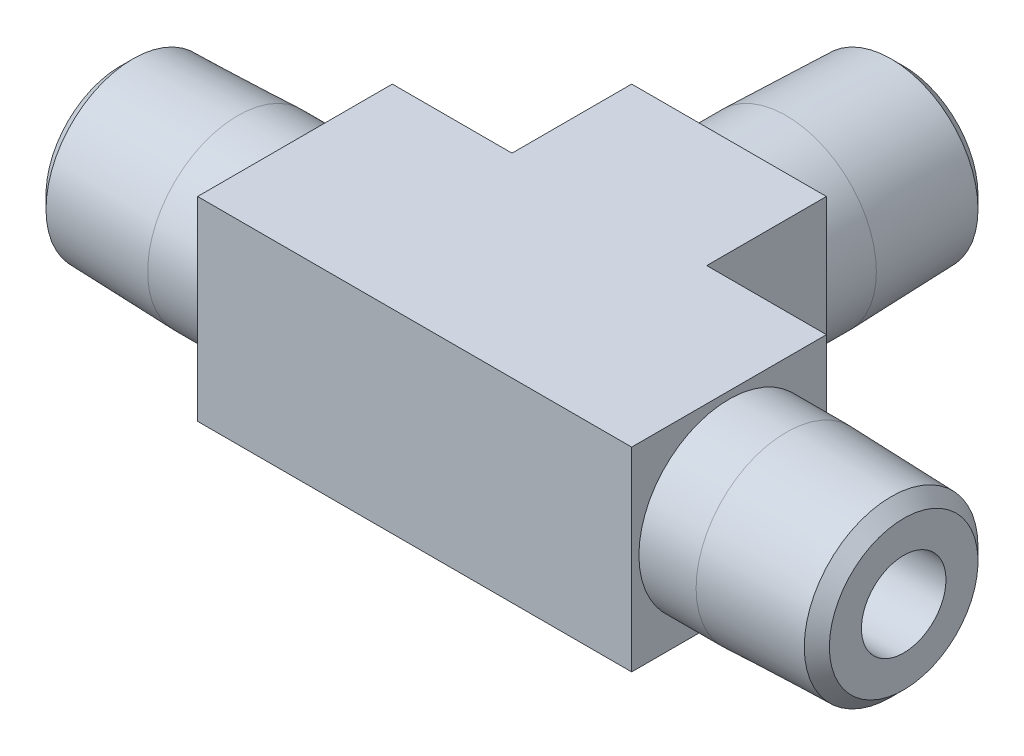
ISO-10303-21;
HEADER;
FILE_DESCRIPTION(('STEP AP214'),'2;1');
FILE_NAME('part.step','',(''),(''),'','','');
FILE_SCHEMA(('AUTOMOTIVE_DESIGN { 1 0 10303 214 1 1 1 1 }'));
ENDSEC;
DATA;
#1=APPLICATION_CONTEXT('core data for automotive mechanical design processes');
#2=APPLICATION_PROTOCOL_DEFINITION('international standard','automotive_design',2000,#1);
#3=PRODUCT_CONTEXT('',#1,'mechanical');
#4=PRODUCT('Part','Part','',(#3));
#5=PRODUCT_RELATED_PRODUCT_CATEGORY('part','',(#4));
#6=PRODUCT_DEFINITION_FORMATION('','',#4);
#7=PRODUCT_DEFINITION_CONTEXT('part definition',#1,'design');
#8=PRODUCT_DEFINITION('design','',#6,#7);
#9=PRODUCT_DEFINITION_SHAPE('','',#8);
#10=(LENGTH_UNIT() NAMED_UNIT(*) SI_UNIT(.MILLI.,.METRE.));
#11=(NAMED_UNIT(*) PLANE_ANGLE_UNIT() SI_UNIT($,.RADIAN.));
#12=(NAMED_UNIT(*) SI_UNIT($,.STERADIAN.) SOLID_ANGLE_UNIT());
#13=UNCERTAINTY_MEASURE_WITH_UNIT(LENGTH_MEASURE(1.E-05),#10,'distance_accuracy_value','');
#14=(GEOMETRIC_REPRESENTATION_CONTEXT(3) GLOBAL_UNCERTAINTY_ASSIGNED_CONTEXT((#13)) GLOBAL_UNIT_ASSIGNED_CONTEXT((#10,
#11,#12)) REPRESENTATION_CONTEXT('',''));
#15=CARTESIAN_POINT('',(0.,0.,0.));
#16=DIRECTION('',(0.,0.,1.));
#17=DIRECTION('',(1.,0.,0.));
#18=AXIS2_PLACEMENT_3D('',#15,#16,#17);
#19=CARTESIAN_POINT('',(22.352,0.,-17.36852));
#20=DIRECTION('',(0.,0.,-1.));
#21=DIRECTION('',(-1.,0.,0.));
#22=AXIS2_PLACEMENT_3D('',#19,#20,#21);
#23=CYLINDRICAL_SURFACE('',#22,2.413);
#24=CARTESIAN_POINT('',(22.352,0.,-22.352));
#25=DIRECTION('',(0.,0.,-1.));
#26=DIRECTION('',(-1.,0.,0.));
#27=AXIS2_PLACEMENT_3D('',#24,#25,#26);
#28=CIRCLE('',#27,2.413);
#29=CARTESIAN_POINT('',(19.939,0.,-22.352));
#30=VERTEX_POINT('',#29);
#31=EDGE_CURVE('E89',#30,#30,#28,.F.);
#32=ORIENTED_EDGE('',*,*,#31,.F.);
#33=EDGE_LOOP('',(#32));
#34=FACE_BOUND('',#33,.T.);
#35=CARTESIAN_POINT('',(22.352,0.,0.));
#36=DIRECTION('',(0.707106781186548,0.,-0.707106781186547));
#37=DIRECTION('',(-0.707106781186547,0.,-0.707106781186548));
#38=AXIS2_PLACEMENT_3D('',#35,#36,#37);
#39=ELLIPSE('',#38,3.41249732600628,2.413);
#40=CARTESIAN_POINT('',(22.352,2.413,0.));
#41=VERTEX_POINT('',#40);
#42=CARTESIAN_POINT('',(22.352,-2.413,0.));
#43=VERTEX_POINT('',#42);
#44=EDGE_CURVE('E88',#41,#43,#39,.F.);
#45=ORIENTED_EDGE('',*,*,#44,.T.);
#46=CARTESIAN_POINT('',(22.352,0.,0.));
#47=DIRECTION('',(-0.707106781186547,0.,-0.707106781186548));
#48=DIRECTION('',(0.707106781186548,0.,-0.707106781186547));
#49=AXIS2_PLACEMENT_3D('',#46,#47,#48);
#50=ELLIPSE('',#49,3.41249732600628,2.413);
#51=EDGE_CURVE('E20',#43,#41,#50,.F.);
#52=ORIENTED_EDGE('',*,*,#51,.T.);
#53=EDGE_LOOP('',(#45,#52));
#54=FACE_BOUND('',#53,.T.);
#55=ADVANCED_FACE('F17',(#34,#54),#23,.F.);
#56=CARTESIAN_POINT('',(39.72052,0.,0.));
#57=DIRECTION('',(1.,0.,0.));
#58=DIRECTION('',(0.,0.,-1.));
#59=AXIS2_PLACEMENT_3D('',#56,#57,#58);
#60=CYLINDRICAL_SURFACE('',#59,2.413);
#61=CARTESIAN_POINT('',(0.,0.,0.));
#62=DIRECTION('',(1.,0.,0.));
#63=DIRECTION('',(0.,0.,-1.));
#64=AXIS2_PLACEMENT_3D('',#61,#62,#63);
#65=CIRCLE('',#64,2.413);
#66=CARTESIAN_POINT('',(0.,0.,-2.413));
#67=VERTEX_POINT('',#66);
#68=EDGE_CURVE('E96',#67,#67,#65,.T.);
#69=ORIENTED_EDGE('',*,*,#68,.F.);
#70=EDGE_LOOP('',(#69));
#71=FACE_BOUND('',#70,.T.);
#72=CARTESIAN_POINT('',(44.704,0.,0.));
#73=DIRECTION('',(1.,0.,0.));
#74=DIRECTION('',(0.,0.,-1.));
#75=AXIS2_PLACEMENT_3D('',#72,#73,#74);
#76=CIRCLE('',#75,2.413);
#77=CARTESIAN_POINT('',(44.704,0.,-2.413));
#78=VERTEX_POINT('',#77);
#79=EDGE_CURVE('E91',#78,#78,#76,.F.);
#80=ORIENTED_EDGE('',*,*,#79,.F.);
#81=EDGE_LOOP('',(#80));
#82=FACE_BOUND('',#81,.T.);
#83=ORIENTED_EDGE('',*,*,#51,.F.);
#84=ORIENTED_EDGE('',*,*,#44,.F.);
#85=EDGE_LOOP('',(#83,#84));
#86=FACE_BOUND('',#85,.T.);
#87=ADVANCED_FACE('F87',(#71,#82,#86),#60,.F.);
#88=CARTESIAN_POINT('',(19.8846001989067,0.,-22.352));
#89=DIRECTION('',(0.,0.,-1.));
#90=DIRECTION('',(-1.,0.,0.));
#91=AXIS2_PLACEMENT_3D('',#88,#89,#90);
#92=PLANE('',#91);
#93=CARTESIAN_POINT('',(22.352,0.,-22.3520000000121));
#94=DIRECTION('',(0.,0.,1.));
#95=DIRECTION('',(1.,0.,0.));
#96=AXIS2_PLACEMENT_3D('',#93,#94,#95);
#97=CIRCLE('',#96,4.24052999999198);
#98=CARTESIAN_POINT('',(26.592529999992,0.,-22.3520000000121));
#99=VERTEX_POINT('',#98);
#100=EDGE_CURVE('E99',#99,#99,#97,.T.);
#101=ORIENTED_EDGE('',*,*,#100,.F.);
#102=EDGE_LOOP('',(#101));
#103=FACE_BOUND('',#102,.T.);
#104=ORIENTED_EDGE('',*,*,#31,.T.);
#105=EDGE_LOOP('',(#104));
#106=FACE_BOUND('',#105,.T.);
#107=ADVANCED_FACE('F281',(#103,#106),#92,.T.);
#108=CARTESIAN_POINT('',(44.704,0.,-2.46739980109326));
#109=DIRECTION('',(1.,0.,0.));
#110=DIRECTION('',(0.,0.,-1.));
#111=AXIS2_PLACEMENT_3D('',#108,#109,#110);
#112=PLANE('',#111);
#113=CARTESIAN_POINT('',(44.7040000000243,0.,0.));
#114=DIRECTION('',(-1.,0.,0.));
#115=DIRECTION('',(0.,0.,1.));
#116=AXIS2_PLACEMENT_3D('',#113,#114,#115);
#117=CIRCLE('',#116,4.24052999994728);
#118=CARTESIAN_POINT('',(44.7040000000243,0.,4.24052999994728));
#119=VERTEX_POINT('',#118);
#120=EDGE_CURVE('E102',#119,#119,#117,.T.);
#121=ORIENTED_EDGE('',*,*,#120,.F.);
#122=EDGE_LOOP('',(#121));
#123=FACE_BOUND('',#122,.T.);
#124=ORIENTED_EDGE('',*,*,#79,.T.);
#125=EDGE_LOOP('',(#124));
#126=FACE_BOUND('',#125,.T.);
#127=ADVANCED_FACE('F275',(#123,#126),#112,.T.);
#128=CARTESIAN_POINT('',(0.,0.,2.46739980109326));
#129=DIRECTION('',(-1.,0.,0.));
#130=DIRECTION('',(0.,0.,1.));
#131=AXIS2_PLACEMENT_3D('',#128,#129,#130);
#132=PLANE('',#131);
#133=CARTESIAN_POINT('',(-5.68432020203735E-11,0.,0.));
#134=DIRECTION('',(1.,0.,0.));
#135=DIRECTION('',(0.,0.,-1.));
#136=AXIS2_PLACEMENT_3D('',#133,#134,#135);
#137=CIRCLE('',#136,4.24053000000413);
#138=CARTESIAN_POINT('',(-5.68425527884566E-11,0.,-4.24053000000413));
#139=VERTEX_POINT('',#138);
#140=EDGE_CURVE('E105',#139,#139,#137,.T.);
#141=ORIENTED_EDGE('',*,*,#140,.F.);
#142=EDGE_LOOP('',(#141));
#143=FACE_BOUND('',#142,.T.);
#144=ORIENTED_EDGE('',*,*,#68,.T.);
#145=EDGE_LOOP('',(#144));
#146=FACE_BOUND('',#145,.T.);
#147=ADVANCED_FACE('F271',(#143,#146),#132,.T.);
#148=CARTESIAN_POINT('',(22.352,0.,-21.6354196002726));
#149=DIRECTION('',(0.,0.,1.));
#150=DIRECTION('',(1.,0.,0.));
#151=AXIS2_PLACEMENT_3D('',#148,#149,#150);
#152=CONICAL_SURFACE('',#151,4.95711039973153,0.785398163397448);
#153=CARTESIAN_POINT('',(22.352,0.,-21.6354196002726));
#154=DIRECTION('',(0.,0.,1.));
#155=DIRECTION('',(-1.,0.,0.));
#156=AXIS2_PLACEMENT_3D('',#153,#154,#155);
#157=CIRCLE('',#156,4.95711039971377);
#158=CARTESIAN_POINT('',(17.3948896002862,0.,-21.6354196002726));
#159=VERTEX_POINT('',#158);
#160=EDGE_CURVE('E108',#159,#159,#157,.T.);
#161=ORIENTED_EDGE('',*,*,#160,.F.);
#162=EDGE_LOOP('',(#161));
#163=FACE_BOUND('',#162,.T.);
#164=ORIENTED_EDGE('',*,*,#100,.T.);
#165=EDGE_LOOP('',(#164));
#166=FACE_BOUND('',#165,.T.);
#167=ADVANCED_FACE('F274',(#163,#166),#152,.T.);
#168=CARTESIAN_POINT('',(43.9874196002847,0.,0.));
#169=DIRECTION('',(-1.,0.,0.));
#170=DIRECTION('',(0.,0.,1.));
#171=AXIS2_PLACEMENT_3D('',#168,#169,#170);
#172=CONICAL_SURFACE('',#171,4.95711039968683,0.785398163397448);
#173=CARTESIAN_POINT('',(43.9874196002847,0.,0.));
#174=DIRECTION('',(-1.,0.,0.));
#175=DIRECTION('',(0.,0.,-1.));
#176=AXIS2_PLACEMENT_3D('',#173,#174,#175);
#177=CIRCLE('',#176,4.95711039971347);
#178=CARTESIAN_POINT('',(43.9874196002847,0.,-4.95711039971347));
#179=VERTEX_POINT('',#178);
#180=EDGE_CURVE('E126',#179,#179,#177,.T.);
#181=ORIENTED_EDGE('',*,*,#180,.F.);
#182=EDGE_LOOP('',(#181));
#183=FACE_BOUND('',#182,.T.);
#184=ORIENTED_EDGE('',*,*,#120,.T.);
#185=EDGE_LOOP('',(#184));
#186=FACE_BOUND('',#185,.T.);
#187=ADVANCED_FACE('F267',(#183,#186),#172,.T.);
#188=CARTESIAN_POINT('',(0.716580399682699,0.,0.));
#189=DIRECTION('',(1.,0.,0.));
#190=DIRECTION('',(0.,0.,-1.));
#191=AXIS2_PLACEMENT_3D('',#188,#189,#190);
#192=CONICAL_SURFACE('',#191,4.95711039968683,0.785398163357785);
#193=CARTESIAN_POINT('',(0.716580399739541,0.,0.));
#194=DIRECTION('',(1.,0.,0.));
#195=DIRECTION('',(0.,0.,1.));
#196=AXIS2_PLACEMENT_3D('',#193,#194,#195);
#197=CIRCLE('',#196,4.95711039971703);
#198=CARTESIAN_POINT('',(0.716580399739541,0.,4.95711039971702));
#199=VERTEX_POINT('',#198);
#200=EDGE_CURVE('E129',#199,#199,#197,.T.);
#201=ORIENTED_EDGE('',*,*,#200,.F.);
#202=EDGE_LOOP('',(#201));
#203=FACE_BOUND('',#202,.T.);
#204=ORIENTED_EDGE('',*,*,#140,.T.);
#205=EDGE_LOOP('',(#204));
#206=FACE_BOUND('',#205,.T.);
#207=ADVANCED_FACE('F263',(#203,#206),#192,.T.);
#208=CARTESIAN_POINT('',(22.352,0.,-15.6489400000055));
#209=DIRECTION('',(0.,0.,1.));
#210=DIRECTION('',(1.,0.,0.));
#211=AXIS2_PLACEMENT_3D('',#208,#209,#210);
#212=CONICAL_SURFACE('',#211,5.14349999999759,0.031125038321427);
#213=CARTESIAN_POINT('',(22.352,0.,-15.64894));
#214=DIRECTION('',(0.,0.,1.));
#215=DIRECTION('',(1.,0.,0.));
#216=AXIS2_PLACEMENT_3D('',#213,#214,#215);
#217=CIRCLE('',#216,5.1435);
#218=CARTESIAN_POINT('',(27.4955,0.,-15.64894));
#219=VERTEX_POINT('',#218);
#220=EDGE_CURVE('E132',#219,#219,#217,.T.);
#221=ORIENTED_EDGE('',*,*,#220,.F.);
#222=EDGE_LOOP('',(#221));
#223=FACE_BOUND('',#222,.T.);
#224=ORIENTED_EDGE('',*,*,#160,.T.);
#225=EDGE_LOOP('',(#224));
#226=FACE_BOUND('',#225,.T.);
#227=ADVANCED_FACE('F266',(#223,#226),#212,.T.);
#228=CARTESIAN_POINT('',(38.0009400000176,0.,0.));
#229=DIRECTION('',(-1.,0.,0.));
#230=DIRECTION('',(0.,0.,1.));
#231=AXIS2_PLACEMENT_3D('',#228,#229,#230);
#232=CONICAL_SURFACE('',#231,5.14349999999908,0.0311250383217229);
#233=CARTESIAN_POINT('',(38.00094,0.,0.));
#234=DIRECTION('',(-1.,0.,0.));
#235=DIRECTION('',(0.,0.,1.));
#236=AXIS2_PLACEMENT_3D('',#233,#234,#235);
#237=CIRCLE('',#236,5.1435);
#238=CARTESIAN_POINT('',(38.00094,0.,5.1435));
#239=VERTEX_POINT('',#238);
#240=EDGE_CURVE('E135',#239,#239,#237,.T.);
#241=ORIENTED_EDGE('',*,*,#240,.F.);
#242=EDGE_LOOP('',(#241));
#243=FACE_BOUND('',#242,.T.);
#244=ORIENTED_EDGE('',*,*,#180,.T.);
#245=EDGE_LOOP('',(#244));
#246=FACE_BOUND('',#245,.T.);
#247=ADVANCED_FACE('F259',(#243,#246),#232,.T.);
#248=CARTESIAN_POINT('',(6.70306000006349,0.,0.));
#249=DIRECTION('',(1.,0.,0.));
#250=DIRECTION('',(0.,0.,-1.));
#251=AXIS2_PLACEMENT_3D('',#248,#249,#250);
#252=CONICAL_SURFACE('',#251,5.14350000000263,0.0311250383214272);
#253=CARTESIAN_POINT('',(6.70306,0.,0.));
#254=DIRECTION('',(1.,0.,0.));
#255=DIRECTION('',(0.,0.,-1.));
#256=AXIS2_PLACEMENT_3D('',#253,#254,#255);
#257=CIRCLE('',#256,5.1435);
#258=CARTESIAN_POINT('',(6.70306,0.,-5.1435));
#259=VERTEX_POINT('',#258);
#260=EDGE_CURVE('E138',#259,#259,#257,.T.);
#261=ORIENTED_EDGE('',*,*,#260,.F.);
#262=EDGE_LOOP('',(#261));
#263=FACE_BOUND('',#262,.T.);
#264=ORIENTED_EDGE('',*,*,#200,.T.);
#265=EDGE_LOOP('',(#264));
#266=FACE_BOUND('',#265,.T.);
#267=ADVANCED_FACE('F255',(#263,#266),#252,.T.);
#268=CARTESIAN_POINT('',(22.352,0.,-14.01699));
#269=DIRECTION('',(0.,0.,1.));
#270=DIRECTION('',(1.,0.,0.));
#271=AXIS2_PLACEMENT_3D('',#268,#269,#270);
#272=CYLINDRICAL_SURFACE('',#271,5.1435);
#273=CARTESIAN_POINT('',(22.352,0.,-12.38504));
#274=DIRECTION('',(0.,0.,1.));
#275=DIRECTION('',(1.,0.,0.));
#276=AXIS2_PLACEMENT_3D('',#273,#274,#275);
#277=CIRCLE('',#276,5.1435);
#278=CARTESIAN_POINT('',(27.4955,0.,-12.38504));
#279=VERTEX_POINT('',#278);
#280=EDGE_CURVE('E109',#279,#279,#277,.T.);
#281=ORIENTED_EDGE('',*,*,#280,.F.);
#282=EDGE_LOOP('',(#281));
#283=FACE_BOUND('',#282,.T.);
#284=ORIENTED_EDGE('',*,*,#220,.T.);
#285=EDGE_LOOP('',(#284));
#286=FACE_BOUND('',#285,.T.);
#287=ADVANCED_FACE('F258',(#283,#286),#272,.T.);
#288=CARTESIAN_POINT('',(36.36899,0.,0.));
#289=DIRECTION('',(-1.,0.,0.));
#290=DIRECTION('',(0.,0.,1.));
#291=AXIS2_PLACEMENT_3D('',#288,#289,#290);
#292=CYLINDRICAL_SURFACE('',#291,5.1435);
#293=CARTESIAN_POINT('',(34.73704,0.,0.));
#294=DIRECTION('',(-1.,0.,0.));
#295=DIRECTION('',(0.,0.,1.));
#296=AXIS2_PLACEMENT_3D('',#293,#294,#295);
#297=CIRCLE('',#296,5.1435);
#298=CARTESIAN_POINT('',(34.73704,0.,5.1435));
#299=VERTEX_POINT('',#298);
#300=EDGE_CURVE('E114',#299,#299,#297,.T.);
#301=ORIENTED_EDGE('',*,*,#300,.F.);
#302=EDGE_LOOP('',(#301));
#303=FACE_BOUND('',#302,.T.);
#304=ORIENTED_EDGE('',*,*,#240,.T.);
#305=EDGE_LOOP('',(#304));
#306=FACE_BOUND('',#305,.T.);
#307=ADVANCED_FACE('F251',(#303,#306),#292,.T.);
#308=CARTESIAN_POINT('',(8.33501,0.,0.));
#309=DIRECTION('',(1.,0.,0.));
#310=DIRECTION('',(0.,0.,-1.));
#311=AXIS2_PLACEMENT_3D('',#308,#309,#310);
#312=CYLINDRICAL_SURFACE('',#311,5.1435);
#313=CARTESIAN_POINT('',(9.96696,0.,0.));
#314=DIRECTION('',(1.,0.,0.));
#315=DIRECTION('',(0.,0.,-1.));
#316=AXIS2_PLACEMENT_3D('',#313,#314,#315);
#317=CIRCLE('',#316,5.1435);
#318=CARTESIAN_POINT('',(9.96696,0.,-5.1435));
#319=VERTEX_POINT('',#318);
#320=EDGE_CURVE('E119',#319,#319,#317,.T.);
#321=ORIENTED_EDGE('',*,*,#320,.F.);
#322=EDGE_LOOP('',(#321));
#323=FACE_BOUND('',#322,.T.);
#324=ORIENTED_EDGE('',*,*,#260,.T.);
#325=EDGE_LOOP('',(#324));
#326=FACE_BOUND('',#325,.T.);
#327=ADVANCED_FACE('F248',(#323,#326),#312,.T.);
#328=CARTESIAN_POINT('',(9.96696,5.55625,5.55625));
#329=DIRECTION('',(0.,1.,0.));
#330=DIRECTION('',(-1.,0.,0.));
#331=AXIS2_PLACEMENT_3D('',#328,#329,#330);
#332=PLANE('',#331);
#333=DIRECTION('',(-1.,0.,0.));
#334=VECTOR('',#333,1.);
#335=CARTESIAN_POINT('',(25.130125,5.55625,-12.38504));
#336=LINE('',#335,#334);
#337=CARTESIAN_POINT('',(16.79575,5.55625,-12.38504));
#338=VERTEX_POINT('',#337);
#339=CARTESIAN_POINT('',(27.90825,5.55625,-12.38504));
#340=VERTEX_POINT('',#339);
#341=EDGE_CURVE('E113',#338,#340,#336,.F.);
#342=ORIENTED_EDGE('',*,*,#341,.F.);
#343=DIRECTION('',(0.,0.,1.));
#344=VECTOR('',#343,1.);
#345=CARTESIAN_POINT('',(16.79575,5.55625,0.));
#346=LINE('',#345,#344);
#347=CARTESIAN_POINT('',(16.79575,5.55625,-5.55625));
#348=VERTEX_POINT('',#347);
#349=EDGE_CURVE('E141',#348,#338,#346,.F.);
#350=ORIENTED_EDGE('',*,*,#349,.F.);
#351=DIRECTION('',(-1.,0.,0.));
#352=VECTOR('',#351,1.);
#353=CARTESIAN_POINT('',(9.96696,5.55625,-5.55625));
#354=LINE('',#353,#352);
#355=CARTESIAN_POINT('',(9.96696,5.55625,-5.55625));
#356=VERTEX_POINT('',#355);
#357=EDGE_CURVE('E172',#356,#348,#354,.F.);
#358=ORIENTED_EDGE('',*,*,#357,.F.);
#359=DIRECTION('',(0.,0.,1.));
#360=VECTOR('',#359,1.);
#361=CARTESIAN_POINT('',(9.96696,5.55625,-2.778125));
#362=LINE('',#361,#360);
#363=CARTESIAN_POINT('',(9.96696,5.55625,5.55625));
#364=VERTEX_POINT('',#363);
#365=EDGE_CURVE('E123',#364,#356,#362,.F.);
#366=ORIENTED_EDGE('',*,*,#365,.F.);
#367=DIRECTION('',(1.,0.,0.));
#368=VECTOR('',#367,1.);
#369=CARTESIAN_POINT('',(9.96696,5.55625,5.55625));
#370=LINE('',#369,#368);
#371=CARTESIAN_POINT('',(34.73704,5.55625,5.55625));
#372=VERTEX_POINT('',#371);
#373=EDGE_CURVE('E163',#372,#364,#370,.F.);
#374=ORIENTED_EDGE('',*,*,#373,.F.);
#375=DIRECTION('',(0.,0.,-1.));
#376=VECTOR('',#375,1.);
#377=CARTESIAN_POINT('',(34.73704,5.55625,-2.778125));
#378=LINE('',#377,#376);
#379=CARTESIAN_POINT('',(34.73704,5.55625,-5.55625));
#380=VERTEX_POINT('',#379);
#381=EDGE_CURVE('E157',#380,#372,#378,.F.);
#382=ORIENTED_EDGE('',*,*,#381,.F.);
#383=DIRECTION('',(-1.,0.,0.));
#384=VECTOR('',#383,1.);
#385=CARTESIAN_POINT('',(9.96696,5.55625,-5.55625));
#386=LINE('',#385,#384);
#387=CARTESIAN_POINT('',(27.90825,5.55625,-5.55625));
#388=VERTEX_POINT('',#387);
#389=EDGE_CURVE('E154',#388,#380,#386,.F.);
#390=ORIENTED_EDGE('',*,*,#389,.F.);
#391=DIRECTION('',(0.,0.,1.));
#392=VECTOR('',#391,1.);
#393=CARTESIAN_POINT('',(27.90825,5.55625,0.));
#394=LINE('',#393,#392);
#395=EDGE_CURVE('E149',#340,#388,#394,.T.);
#396=ORIENTED_EDGE('',*,*,#395,.F.);
#397=EDGE_LOOP('',(#342,#350,#358,#366,#374,#382,#390,#396));
#398=FACE_BOUND('',#397,.T.);
#399=ADVANCED_FACE('F205',(#398),#332,.T.);
#400=CARTESIAN_POINT('',(16.79575,5.55625,0.));
#401=DIRECTION('',(-1.,0.,0.));
#402=DIRECTION('',(0.,-1.,0.));
#403=AXIS2_PLACEMENT_3D('',#400,#401,#402);
#404=PLANE('',#403);
#405=DIRECTION('',(0.,1.,0.));
#406=VECTOR('',#405,1.);
#407=CARTESIAN_POINT('',(16.79575,5.55625,-5.55625));
#408=LINE('',#407,#406);
#409=CARTESIAN_POINT('',(16.79575,-5.55625,-5.55625));
#410=VERTEX_POINT('',#409);
#411=EDGE_CURVE('E122',#348,#410,#408,.F.);
#412=ORIENTED_EDGE('',*,*,#411,.F.);
#413=ORIENTED_EDGE('',*,*,#349,.T.);
#414=DIRECTION('',(0.,1.,0.));
#415=VECTOR('',#414,1.);
#416=CARTESIAN_POINT('',(16.79575,0.,-12.38504));
#417=LINE('',#416,#415);
#418=CARTESIAN_POINT('',(16.79575,-5.55625,-12.38504));
#419=VERTEX_POINT('',#418);
#420=EDGE_CURVE('E143',#419,#338,#417,.T.);
#421=ORIENTED_EDGE('',*,*,#420,.F.);
#422=DIRECTION('',(0.,0.,1.));
#423=VECTOR('',#422,1.);
#424=CARTESIAN_POINT('',(16.79575,-5.55625,-5.55625));
#425=LINE('',#424,#423);
#426=EDGE_CURVE('E175',#410,#419,#425,.F.);
#427=ORIENTED_EDGE('',*,*,#426,.F.);
#428=EDGE_LOOP('',(#412,#413,#421,#427));
#429=FACE_BOUND('',#428,.T.);
#430=ADVANCED_FACE('F210',(#429),#404,.T.);
#431=CARTESIAN_POINT('',(25.130125,0.,-12.38504));
#432=DIRECTION('',(0.,0.,-1.));
#433=DIRECTION('',(-1.,0.,0.));
#434=AXIS2_PLACEMENT_3D('',#431,#432,#433);
#435=PLANE('',#434);
#436=ORIENTED_EDGE('',*,*,#280,.T.);
#437=EDGE_LOOP('',(#436));
#438=FACE_BOUND('',#437,.T.);
#439=ORIENTED_EDGE('',*,*,#341,.T.);
#440=DIRECTION('',(0.,1.,0.));
#441=VECTOR('',#440,1.);
#442=CARTESIAN_POINT('',(27.90825,-5.55625,-12.38504));
#443=LINE('',#442,#441);
#444=CARTESIAN_POINT('',(27.90825,-5.55625,-12.38504));
#445=VERTEX_POINT('',#444);
#446=EDGE_CURVE('E112',#445,#340,#443,.T.);
#447=ORIENTED_EDGE('',*,*,#446,.F.);
#448=DIRECTION('',(1.,0.,0.));
#449=VECTOR('',#448,1.);
#450=CARTESIAN_POINT('',(9.96696,-5.55625,-12.38504));
#451=LINE('',#450,#449);
#452=EDGE_CURVE('E178',#419,#445,#451,.T.);
#453=ORIENTED_EDGE('',*,*,#452,.F.);
#454=ORIENTED_EDGE('',*,*,#420,.T.);
#455=EDGE_LOOP('',(#439,#447,#453,#454));
#456=FACE_BOUND('',#455,.T.);
#457=ADVANCED_FACE('F214',(#438,#456),#435,.T.);
#458=CARTESIAN_POINT('',(27.90825,-5.55625,0.));
#459=DIRECTION('',(1.,0.,0.));
#460=DIRECTION('',(0.,1.,0.));
#461=AXIS2_PLACEMENT_3D('',#458,#459,#460);
#462=PLANE('',#461);
#463=ORIENTED_EDGE('',*,*,#446,.T.);
#464=ORIENTED_EDGE('',*,*,#395,.T.);
#465=DIRECTION('',(0.,1.,0.));
#466=VECTOR('',#465,1.);
#467=CARTESIAN_POINT('',(27.90825,5.55625,-5.55625));
#468=LINE('',#467,#466);
#469=CARTESIAN_POINT('',(27.90825,-5.55625,-5.55625));
#470=VERTEX_POINT('',#469);
#471=EDGE_CURVE('E151',#470,#388,#468,.T.);
#472=ORIENTED_EDGE('',*,*,#471,.F.);
#473=DIRECTION('',(0.,0.,1.));
#474=VECTOR('',#473,1.);
#475=CARTESIAN_POINT('',(27.90825,-5.55625,-5.55625));
#476=LINE('',#475,#474);
#477=EDGE_CURVE('E181',#445,#470,#476,.T.);
#478=ORIENTED_EDGE('',*,*,#477,.F.);
#479=EDGE_LOOP('',(#463,#464,#472,#478));
#480=FACE_BOUND('',#479,.T.);
#481=ADVANCED_FACE('F217',(#480),#462,.T.);
#482=CARTESIAN_POINT('',(9.96696,5.55625,-5.55625));
#483=DIRECTION('',(0.,0.,-1.));
#484=DIRECTION('',(-1.,0.,0.));
#485=AXIS2_PLACEMENT_3D('',#482,#483,#484);
#486=PLANE('',#485);
#487=DIRECTION('',(0.,1.,0.));
#488=VECTOR('',#487,1.);
#489=CARTESIAN_POINT('',(34.73704,0.,-5.55625));
#490=LINE('',#489,#488);
#491=CARTESIAN_POINT('',(34.73704,-5.55625,-5.55625));
#492=VERTEX_POINT('',#491);
#493=EDGE_CURVE('E118',#492,#380,#490,.T.);
#494=ORIENTED_EDGE('',*,*,#493,.F.);
#495=DIRECTION('',(1.,0.,0.));
#496=VECTOR('',#495,1.);
#497=CARTESIAN_POINT('',(9.96696,-5.55625,-5.55625));
#498=LINE('',#497,#496);
#499=EDGE_CURVE('E184',#470,#492,#498,.T.);
#500=ORIENTED_EDGE('',*,*,#499,.F.);
#501=ORIENTED_EDGE('',*,*,#471,.T.);
#502=ORIENTED_EDGE('',*,*,#389,.T.);
#503=EDGE_LOOP('',(#494,#500,#501,#502));
#504=FACE_BOUND('',#503,.T.);
#505=ADVANCED_FACE('F221',(#504),#486,.T.);
#506=CARTESIAN_POINT('',(34.73704,0.,-2.778125));
#507=DIRECTION('',(1.,0.,0.));
#508=DIRECTION('',(0.,0.,-1.));
#509=AXIS2_PLACEMENT_3D('',#506,#507,#508);
#510=PLANE('',#509);
#511=ORIENTED_EDGE('',*,*,#300,.T.);
#512=EDGE_LOOP('',(#511));
#513=FACE_BOUND('',#512,.T.);
#514=DIRECTION('',(0.,0.,1.));
#515=VECTOR('',#514,1.);
#516=CARTESIAN_POINT('',(34.73704,-5.55625,-5.55625));
#517=LINE('',#516,#515);
#518=CARTESIAN_POINT('',(34.73704,-5.55625,5.55625));
#519=VERTEX_POINT('',#518);
#520=EDGE_CURVE('E187',#492,#519,#517,.T.);
#521=ORIENTED_EDGE('',*,*,#520,.F.);
#522=ORIENTED_EDGE('',*,*,#493,.T.);
#523=ORIENTED_EDGE('',*,*,#381,.T.);
#524=DIRECTION('',(0.,1.,0.));
#525=VECTOR('',#524,1.);
#526=CARTESIAN_POINT('',(34.73704,-5.55625,5.55625));
#527=LINE('',#526,#525);
#528=EDGE_CURVE('E117',#519,#372,#527,.T.);
#529=ORIENTED_EDGE('',*,*,#528,.F.);
#530=EDGE_LOOP('',(#521,#522,#523,#529));
#531=FACE_BOUND('',#530,.T.);
#532=ADVANCED_FACE('F224',(#513,#531),#510,.T.);
#533=CARTESIAN_POINT('',(9.96696,-5.55625,5.55625));
#534=DIRECTION('',(0.,0.,1.));
#535=DIRECTION('',(1.,0.,0.));
#536=AXIS2_PLACEMENT_3D('',#533,#534,#535);
#537=PLANE('',#536);
#538=ORIENTED_EDGE('',*,*,#528,.T.);
#539=ORIENTED_EDGE('',*,*,#373,.T.);
#540=DIRECTION('',(0.,1.,0.));
#541=VECTOR('',#540,1.);
#542=CARTESIAN_POINT('',(9.96696,0.,5.55625));
#543=LINE('',#542,#541);
#544=CARTESIAN_POINT('',(9.96696,-5.55625,5.55625));
#545=VERTEX_POINT('',#544);
#546=EDGE_CURVE('E165',#545,#364,#543,.T.);
#547=ORIENTED_EDGE('',*,*,#546,.F.);
#548=DIRECTION('',(1.,0.,0.));
#549=VECTOR('',#548,1.);
#550=CARTESIAN_POINT('',(9.96696,-5.55625,5.55625));
#551=LINE('',#550,#549);
#552=EDGE_CURVE('E190',#519,#545,#551,.F.);
#553=ORIENTED_EDGE('',*,*,#552,.F.);
#554=EDGE_LOOP('',(#538,#539,#547,#553));
#555=FACE_BOUND('',#554,.T.);
#556=ADVANCED_FACE('F201',(#555),#537,.T.);
#557=CARTESIAN_POINT('',(9.96696,0.,-2.778125));
#558=DIRECTION('',(-1.,0.,0.));
#559=DIRECTION('',(0.,0.,1.));
#560=AXIS2_PLACEMENT_3D('',#557,#558,#559);
#561=PLANE('',#560);
#562=ORIENTED_EDGE('',*,*,#320,.T.);
#563=EDGE_LOOP('',(#562));
#564=FACE_BOUND('',#563,.T.);
#565=ORIENTED_EDGE('',*,*,#365,.T.);
#566=DIRECTION('',(0.,1.,0.));
#567=VECTOR('',#566,1.);
#568=CARTESIAN_POINT('',(9.96696,5.55625,-5.55625));
#569=LINE('',#568,#567);
#570=CARTESIAN_POINT('',(9.96696,-5.55625,-5.55625));
#571=VERTEX_POINT('',#570);
#572=EDGE_CURVE('E35',#571,#356,#569,.T.);
#573=ORIENTED_EDGE('',*,*,#572,.F.);
#574=DIRECTION('',(0.,0.,1.));
#575=VECTOR('',#574,1.);
#576=CARTESIAN_POINT('',(9.96696,-5.55625,-5.55625));
#577=LINE('',#576,#575);
#578=EDGE_CURVE('E26',#545,#571,#577,.F.);
#579=ORIENTED_EDGE('',*,*,#578,.F.);
#580=ORIENTED_EDGE('',*,*,#546,.T.);
#581=EDGE_LOOP('',(#565,#573,#579,#580));
#582=FACE_BOUND('',#581,.T.);
#583=ADVANCED_FACE('F197',(#564,#582),#561,.T.);
#584=CARTESIAN_POINT('',(9.96696,5.55625,-5.55625));
#585=DIRECTION('',(0.,0.,-1.));
#586=DIRECTION('',(-1.,0.,0.));
#587=AXIS2_PLACEMENT_3D('',#584,#585,#586);
#588=PLANE('',#587);
#589=ORIENTED_EDGE('',*,*,#572,.T.);
#590=ORIENTED_EDGE('',*,*,#357,.T.);
#591=ORIENTED_EDGE('',*,*,#411,.T.);
#592=DIRECTION('',(1.,0.,0.));
#593=VECTOR('',#592,1.);
#594=CARTESIAN_POINT('',(9.96696,-5.55625,-5.55625));
#595=LINE('',#594,#593);
#596=EDGE_CURVE('E10',#571,#410,#595,.T.);
#597=ORIENTED_EDGE('',*,*,#596,.F.);
#598=EDGE_LOOP('',(#589,#590,#591,#597));
#599=FACE_BOUND('',#598,.T.);
#600=ADVANCED_FACE('F208',(#599),#588,.T.);
#601=CARTESIAN_POINT('',(9.96696,-5.55625,-5.55625));
#602=DIRECTION('',(0.,-1.,0.));
#603=DIRECTION('',(1.,0.,0.));
#604=AXIS2_PLACEMENT_3D('',#601,#602,#603);
#605=PLANE('',#604);
#606=ORIENTED_EDGE('',*,*,#578,.T.);
#607=ORIENTED_EDGE('',*,*,#596,.T.);
#608=ORIENTED_EDGE('',*,*,#426,.T.);
#609=ORIENTED_EDGE('',*,*,#452,.T.);
#610=ORIENTED_EDGE('',*,*,#477,.T.);
#611=ORIENTED_EDGE('',*,*,#499,.T.);
#612=ORIENTED_EDGE('',*,*,#520,.T.);
#613=ORIENTED_EDGE('',*,*,#552,.T.);
#614=EDGE_LOOP('',(#606,#607,#608,#609,#610,#611,#612,#613));
#615=FACE_BOUND('',#614,.T.);
#616=ADVANCED_FACE('F195',(#615),#605,.T.);
#617=CLOSED_SHELL('',(#55,#87,#107,#127,#147,#167,#187,#207,#227,#247,#267,#287,#307,#327,#399,
#430,#457,#481,#505,#532,#556,#583,#600,#616));
#618=MANIFOLD_SOLID_BREP('B1',#617);
#619=ADVANCED_BREP_SHAPE_REPRESENTATION('',(#18,#618),#14);
#620=SHAPE_DEFINITION_REPRESENTATION(#9,#619);
ENDSEC;
END-ISO-10303-21;
